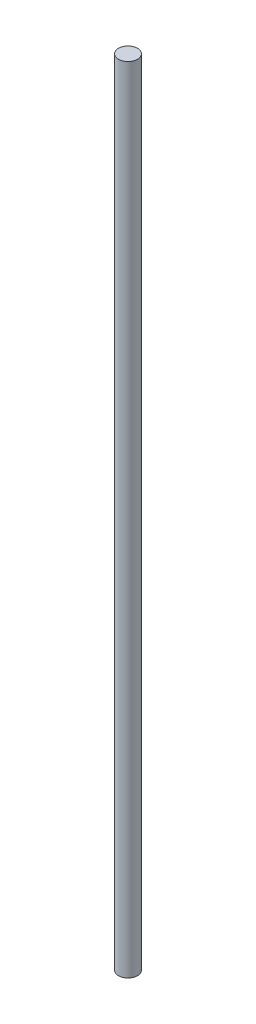
ISO-10303-21;
HEADER;
FILE_DESCRIPTION(('STEP AP214'),'2;1');
FILE_NAME('part.step','',(''),(''),'','','');
FILE_SCHEMA(('AUTOMOTIVE_DESIGN { 1 0 10303 214 1 1 1 1 }'));
ENDSEC;
DATA;
#1=APPLICATION_CONTEXT('core data for automotive mechanical design processes');
#2=APPLICATION_PROTOCOL_DEFINITION('international standard','automotive_design',2000,#1);
#3=PRODUCT_CONTEXT('',#1,'mechanical');
#4=PRODUCT('Part','Part','',(#3));
#5=PRODUCT_RELATED_PRODUCT_CATEGORY('part','',(#4));
#6=PRODUCT_DEFINITION_FORMATION('','',#4);
#7=PRODUCT_DEFINITION_CONTEXT('part definition',#1,'design');
#8=PRODUCT_DEFINITION('design','',#6,#7);
#9=PRODUCT_DEFINITION_SHAPE('','',#8);
#10=(LENGTH_UNIT() NAMED_UNIT(*) SI_UNIT(.MILLI.,.METRE.));
#11=(NAMED_UNIT(*) PLANE_ANGLE_UNIT() SI_UNIT($,.RADIAN.));
#12=(NAMED_UNIT(*) SI_UNIT($,.STERADIAN.) SOLID_ANGLE_UNIT());
#13=UNCERTAINTY_MEASURE_WITH_UNIT(LENGTH_MEASURE(1.E-05),#10,'distance_accuracy_value','');
#14=(GEOMETRIC_REPRESENTATION_CONTEXT(3) GLOBAL_UNCERTAINTY_ASSIGNED_CONTEXT((#13)) GLOBAL_UNIT_ASSIGNED_CONTEXT((#10,
#11,#12)) REPRESENTATION_CONTEXT('',''));
#15=CARTESIAN_POINT('',(0.,0.,0.));
#16=DIRECTION('',(0.,0.,1.));
#17=DIRECTION('',(1.,0.,0.));
#18=AXIS2_PLACEMENT_3D('',#15,#16,#17);
#19=CARTESIAN_POINT('',(0.,500.,0.));
#20=DIRECTION('',(0.,-1.,0.));
#21=DIRECTION('',(0.,0.,-1.));
#22=AXIS2_PLACEMENT_3D('',#19,#20,#21);
#23=CYLINDRICAL_SURFACE('',#22,6.);
#24=CARTESIAN_POINT('',(0.,500.,0.));
#25=DIRECTION('',(0.,1.,0.));
#26=DIRECTION('',(0.,0.,1.));
#27=AXIS2_PLACEMENT_3D('',#24,#25,#26);
#28=CIRCLE('',#27,6.);
#29=CARTESIAN_POINT('',(0.,500.,6.));
#30=VERTEX_POINT('',#29);
#31=EDGE_CURVE('E10',#30,#30,#28,.T.);
#32=ORIENTED_EDGE('',*,*,#31,.F.);
#33=EDGE_LOOP('',(#32));
#34=FACE_BOUND('',#33,.T.);
#35=CARTESIAN_POINT('',(0.,0.,0.));
#36=DIRECTION('',(0.,1.,0.));
#37=DIRECTION('',(0.,0.,1.));
#38=AXIS2_PLACEMENT_3D('',#35,#36,#37);
#39=CIRCLE('',#38,6.);
#40=CARTESIAN_POINT('',(0.,0.,6.));
#41=VERTEX_POINT('',#40);
#42=EDGE_CURVE('E40',#41,#41,#39,.T.);
#43=ORIENTED_EDGE('',*,*,#42,.T.);
#44=EDGE_LOOP('',(#43));
#45=FACE_BOUND('',#44,.T.);
#46=ADVANCED_FACE('F37',(#34,#45),#23,.T.);
#47=CARTESIAN_POINT('',(0.,500.,0.));
#48=DIRECTION('',(0.,1.,0.));
#49=DIRECTION('',(0.,0.,1.));
#50=AXIS2_PLACEMENT_3D('',#47,#48,#49);
#51=PLANE('',#50);
#52=ORIENTED_EDGE('',*,*,#31,.T.);
#53=EDGE_LOOP('',(#52));
#54=FACE_BOUND('',#53,.T.);
#55=ADVANCED_FACE('F54',(#54),#51,.T.);
#56=CARTESIAN_POINT('',(0.,0.,0.));
#57=DIRECTION('',(0.,1.,0.));
#58=DIRECTION('',(0.,0.,1.));
#59=AXIS2_PLACEMENT_3D('',#56,#57,#58);
#60=PLANE('',#59);
#61=ORIENTED_EDGE('',*,*,#42,.F.);
#62=EDGE_LOOP('',(#61));
#63=FACE_BOUND('',#62,.T.);
#64=ADVANCED_FACE('F52',(#63),#60,.F.);
#65=CLOSED_SHELL('',(#46,#55,#64));
#66=MANIFOLD_SOLID_BREP('B2',#65);
#67=ADVANCED_BREP_SHAPE_REPRESENTATION('',(#18,#66),#14);
#68=SHAPE_DEFINITION_REPRESENTATION(#9,#67);
ENDSEC;
END-ISO-10303-21;
